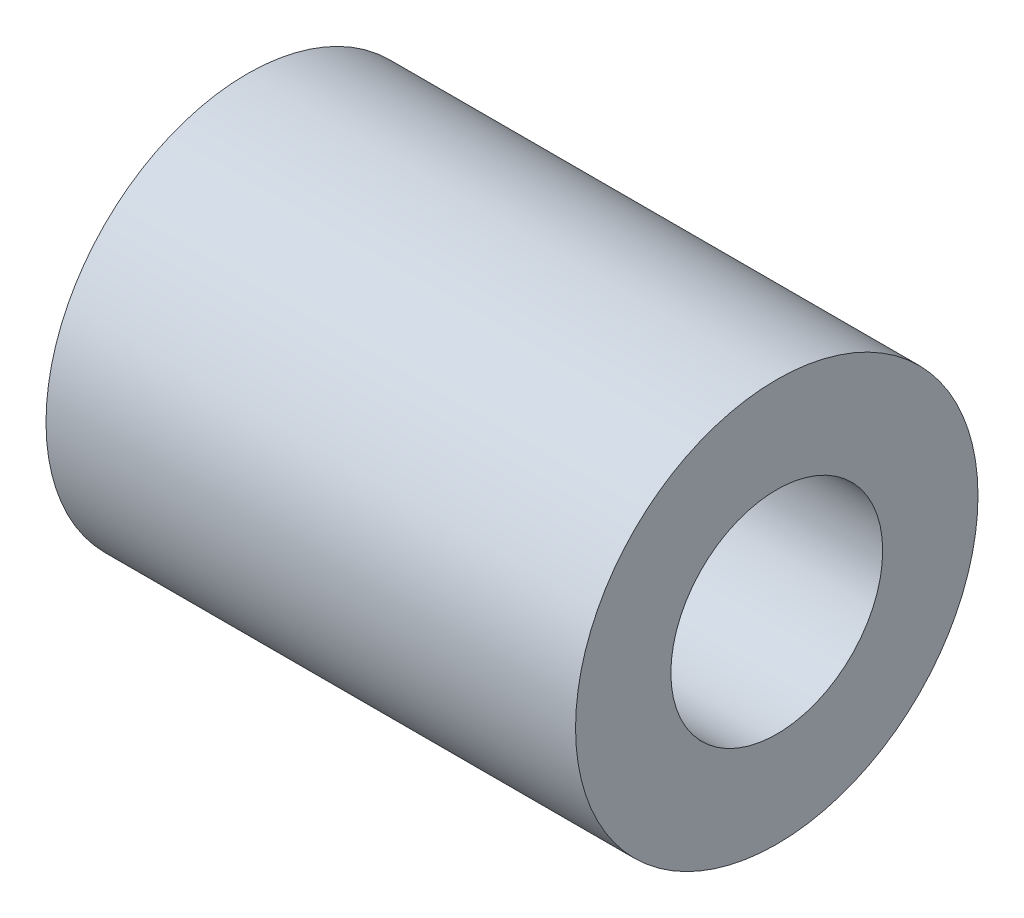
ISO-10303-21;
HEADER;
FILE_DESCRIPTION(('STEP AP214'),'2;1');
FILE_NAME('part.step','',(''),(''),'','','');
FILE_SCHEMA(('AUTOMOTIVE_DESIGN { 1 0 10303 214 1 1 1 1 }'));
ENDSEC;
DATA;
#1=APPLICATION_CONTEXT('core data for automotive mechanical design processes');
#2=APPLICATION_PROTOCOL_DEFINITION('international standard','automotive_design',2000,#1);
#3=PRODUCT_CONTEXT('',#1,'mechanical');
#4=PRODUCT('Part','Part','',(#3));
#5=PRODUCT_RELATED_PRODUCT_CATEGORY('part','',(#4));
#6=PRODUCT_DEFINITION_FORMATION('','',#4);
#7=PRODUCT_DEFINITION_CONTEXT('part definition',#1,'design');
#8=PRODUCT_DEFINITION('design','',#6,#7);
#9=PRODUCT_DEFINITION_SHAPE('','',#8);
#10=(LENGTH_UNIT() NAMED_UNIT(*) SI_UNIT(.MILLI.,.METRE.));
#11=(NAMED_UNIT(*) PLANE_ANGLE_UNIT() SI_UNIT($,.RADIAN.));
#12=(NAMED_UNIT(*) SI_UNIT($,.STERADIAN.) SOLID_ANGLE_UNIT());
#13=UNCERTAINTY_MEASURE_WITH_UNIT(LENGTH_MEASURE(1.E-05),#10,'distance_accuracy_value','');
#14=(GEOMETRIC_REPRESENTATION_CONTEXT(3) GLOBAL_UNCERTAINTY_ASSIGNED_CONTEXT((#13)) GLOBAL_UNIT_ASSIGNED_CONTEXT((#10,
#11,#12)) REPRESENTATION_CONTEXT('',''));
#15=CARTESIAN_POINT('',(0.,0.,0.));
#16=DIRECTION('',(0.,0.,1.));
#17=DIRECTION('',(1.,0.,0.));
#18=AXIS2_PLACEMENT_3D('',#15,#16,#17);
#19=CARTESIAN_POINT('',(0.,0.,0.));
#20=DIRECTION('',(-1.,0.,0.));
#21=DIRECTION('',(0.,0.,1.));
#22=AXIS2_PLACEMENT_3D('',#19,#20,#21);
#23=CYLINDRICAL_SURFACE('',#22,2.5);
#24=CARTESIAN_POINT('',(12.5,0.,0.));
#25=DIRECTION('',(-1.,0.,0.));
#26=DIRECTION('',(0.,0.,1.));
#27=AXIS2_PLACEMENT_3D('',#24,#25,#26);
#28=CIRCLE('',#27,2.5);
#29=CARTESIAN_POINT('',(12.5,0.,2.5));
#30=VERTEX_POINT('',#29);
#31=EDGE_CURVE('E53',#30,#30,#28,.T.);
#32=ORIENTED_EDGE('',*,*,#31,.F.);
#33=EDGE_LOOP('',(#32));
#34=FACE_BOUND('',#33,.T.);
#35=CARTESIAN_POINT('',(0.,0.,0.));
#36=DIRECTION('',(-1.,0.,0.));
#37=DIRECTION('',(0.,0.,1.));
#38=AXIS2_PLACEMENT_3D('',#35,#36,#37);
#39=CIRCLE('',#38,2.5);
#40=CARTESIAN_POINT('',(0.,0.,2.5));
#41=VERTEX_POINT('',#40);
#42=EDGE_CURVE('E10',#41,#41,#39,.T.);
#43=ORIENTED_EDGE('',*,*,#42,.T.);
#44=EDGE_LOOP('',(#43));
#45=FACE_BOUND('',#44,.T.);
#46=ADVANCED_FACE('F31',(#34,#45),#23,.F.);
#47=CARTESIAN_POINT('',(0.,2.5,0.));
#48=DIRECTION('',(1.,0.,0.));
#49=DIRECTION('',(0.,0.,-1.));
#50=AXIS2_PLACEMENT_3D('',#47,#48,#49);
#51=PLANE('',#50);
#52=ORIENTED_EDGE('',*,*,#42,.F.);
#53=EDGE_LOOP('',(#52));
#54=FACE_BOUND('',#53,.T.);
#55=CARTESIAN_POINT('',(0.,0.,0.));
#56=DIRECTION('',(-1.,0.,0.));
#57=DIRECTION('',(0.,0.,1.));
#58=AXIS2_PLACEMENT_3D('',#55,#56,#57);
#59=CIRCLE('',#58,9.5);
#60=CARTESIAN_POINT('',(0.,0.,9.5));
#61=VERTEX_POINT('',#60);
#62=EDGE_CURVE('E37',#61,#61,#59,.T.);
#63=ORIENTED_EDGE('',*,*,#62,.T.);
#64=EDGE_LOOP('',(#63));
#65=FACE_BOUND('',#64,.T.);
#66=ADVANCED_FACE('F60',(#54,#65),#51,.F.);
#67=CARTESIAN_POINT('',(0.,0.,0.));
#68=DIRECTION('',(-1.,0.,0.));
#69=DIRECTION('',(0.,0.,1.));
#70=AXIS2_PLACEMENT_3D('',#67,#68,#69);
#71=CYLINDRICAL_SURFACE('',#70,9.5);
#72=ORIENTED_EDGE('',*,*,#62,.F.);
#73=EDGE_LOOP('',(#72));
#74=FACE_BOUND('',#73,.T.);
#75=CARTESIAN_POINT('',(25.,0.,0.));
#76=DIRECTION('',(-1.,0.,0.));
#77=DIRECTION('',(0.,0.,1.));
#78=AXIS2_PLACEMENT_3D('',#75,#76,#77);
#79=CIRCLE('',#78,9.5);
#80=CARTESIAN_POINT('',(25.,0.,9.5));
#81=VERTEX_POINT('',#80);
#82=EDGE_CURVE('E41',#81,#81,#79,.T.);
#83=ORIENTED_EDGE('',*,*,#82,.T.);
#84=EDGE_LOOP('',(#83));
#85=FACE_BOUND('',#84,.T.);
#86=ADVANCED_FACE('F64',(#74,#85),#71,.T.);
#87=CARTESIAN_POINT('',(25.,9.5,0.));
#88=DIRECTION('',(-1.,0.,0.));
#89=DIRECTION('',(0.,0.,1.));
#90=AXIS2_PLACEMENT_3D('',#87,#88,#89);
#91=PLANE('',#90);
#92=ORIENTED_EDGE('',*,*,#82,.F.);
#93=EDGE_LOOP('',(#92));
#94=FACE_BOUND('',#93,.T.);
#95=CARTESIAN_POINT('',(25.,0.,0.));
#96=DIRECTION('',(-1.,0.,0.));
#97=DIRECTION('',(0.,0.,1.));
#98=AXIS2_PLACEMENT_3D('',#95,#96,#97);
#99=CIRCLE('',#98,5.);
#100=CARTESIAN_POINT('',(25.,0.,5.));
#101=VERTEX_POINT('',#100);
#102=EDGE_CURVE('E45',#101,#101,#99,.T.);
#103=ORIENTED_EDGE('',*,*,#102,.T.);
#104=EDGE_LOOP('',(#103));
#105=FACE_BOUND('',#104,.T.);
#106=ADVANCED_FACE('F69',(#94,#105),#91,.F.);
#107=CARTESIAN_POINT('',(0.,0.,0.));
#108=DIRECTION('',(-1.,0.,0.));
#109=DIRECTION('',(0.,0.,1.));
#110=AXIS2_PLACEMENT_3D('',#107,#108,#109);
#111=CYLINDRICAL_SURFACE('',#110,5.);
#112=ORIENTED_EDGE('',*,*,#102,.F.);
#113=EDGE_LOOP('',(#112));
#114=FACE_BOUND('',#113,.T.);
#115=CARTESIAN_POINT('',(12.5,0.,0.));
#116=DIRECTION('',(-1.,0.,0.));
#117=DIRECTION('',(0.,0.,1.));
#118=AXIS2_PLACEMENT_3D('',#115,#116,#117);
#119=CIRCLE('',#118,5.);
#120=CARTESIAN_POINT('',(12.5,0.,5.));
#121=VERTEX_POINT('',#120);
#122=EDGE_CURVE('E50',#121,#121,#119,.T.);
#123=ORIENTED_EDGE('',*,*,#122,.T.);
#124=EDGE_LOOP('',(#123));
#125=FACE_BOUND('',#124,.T.);
#126=ADVANCED_FACE('F75',(#114,#125),#111,.F.);
#127=CARTESIAN_POINT('',(12.5,5.,0.));
#128=DIRECTION('',(-1.,0.,0.));
#129=DIRECTION('',(0.,0.,1.));
#130=AXIS2_PLACEMENT_3D('',#127,#128,#129);
#131=PLANE('',#130);
#132=ORIENTED_EDGE('',*,*,#122,.F.);
#133=EDGE_LOOP('',(#132));
#134=FACE_BOUND('',#133,.T.);
#135=ORIENTED_EDGE('',*,*,#31,.T.);
#136=EDGE_LOOP('',(#135));
#137=FACE_BOUND('',#136,.T.);
#138=ADVANCED_FACE('F57',(#134,#137),#131,.F.);
#139=CLOSED_SHELL('',(#46,#66,#86,#106,#126,#138));
#140=MANIFOLD_SOLID_BREP('B2',#139);
#141=ADVANCED_BREP_SHAPE_REPRESENTATION('',(#18,#140),#14);
#142=SHAPE_DEFINITION_REPRESENTATION(#9,#141);
ENDSEC;
END-ISO-10303-21;
